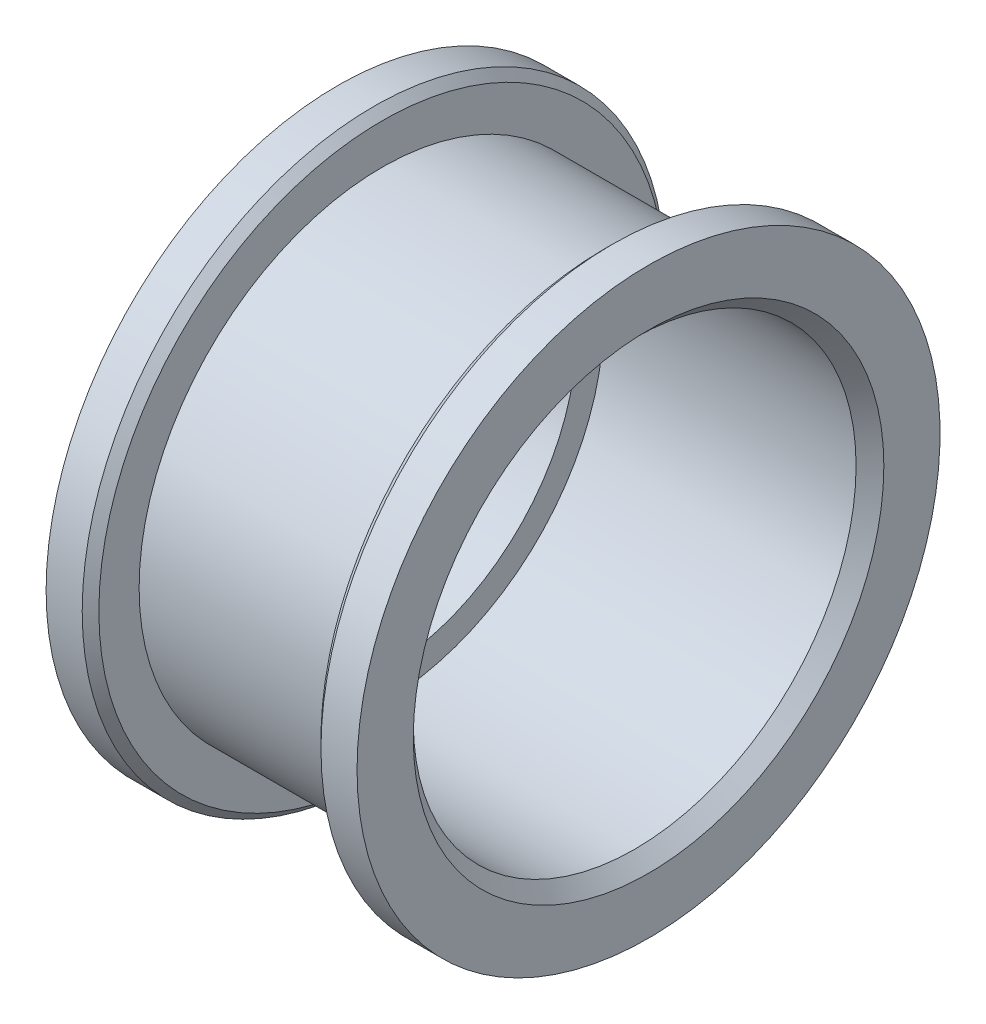
ISO-10303-21;
HEADER;
FILE_DESCRIPTION(('STEP AP214'),'2;1');
FILE_NAME('part.step','',(''),(''),'','','');
FILE_SCHEMA(('AUTOMOTIVE_DESIGN { 1 0 10303 214 1 1 1 1 }'));
ENDSEC;
DATA;
#1=APPLICATION_CONTEXT('core data for automotive mechanical design processes');
#2=APPLICATION_PROTOCOL_DEFINITION('international standard','automotive_design',2000,#1);
#3=PRODUCT_CONTEXT('',#1,'mechanical');
#4=PRODUCT('Part','Part','',(#3));
#5=PRODUCT_RELATED_PRODUCT_CATEGORY('part','',(#4));
#6=PRODUCT_DEFINITION_FORMATION('','',#4);
#7=PRODUCT_DEFINITION_CONTEXT('part definition',#1,'design');
#8=PRODUCT_DEFINITION('design','',#6,#7);
#9=PRODUCT_DEFINITION_SHAPE('','',#8);
#10=(LENGTH_UNIT() NAMED_UNIT(*) SI_UNIT(.MILLI.,.METRE.));
#11=(NAMED_UNIT(*) PLANE_ANGLE_UNIT() SI_UNIT($,.RADIAN.));
#12=(NAMED_UNIT(*) SI_UNIT($,.STERADIAN.) SOLID_ANGLE_UNIT());
#13=UNCERTAINTY_MEASURE_WITH_UNIT(LENGTH_MEASURE(1.E-05),#10,'distance_accuracy_value','');
#14=(GEOMETRIC_REPRESENTATION_CONTEXT(3) GLOBAL_UNCERTAINTY_ASSIGNED_CONTEXT((#13)) GLOBAL_UNIT_ASSIGNED_CONTEXT((#10,
#11,#12)) REPRESENTATION_CONTEXT('',''));
#15=CARTESIAN_POINT('',(0.,0.,0.));
#16=DIRECTION('',(0.,0.,1.));
#17=DIRECTION('',(1.,0.,0.));
#18=AXIS2_PLACEMENT_3D('',#15,#16,#17);
#19=CARTESIAN_POINT('',(6.16,0.,0.));
#20=DIRECTION('',(-1.,0.,0.));
#21=DIRECTION('',(0.,0.,1.));
#22=AXIS2_PLACEMENT_3D('',#19,#20,#21);
#23=CYLINDRICAL_SURFACE('',#22,8.75);
#24=CARTESIAN_POINT('',(4.,0.,0.));
#25=DIRECTION('',(-1.,0.,0.));
#26=DIRECTION('',(0.,0.,1.));
#27=AXIS2_PLACEMENT_3D('',#24,#25,#26);
#28=CIRCLE('',#27,8.75);
#29=CARTESIAN_POINT('',(4.,0.,8.75));
#30=VERTEX_POINT('',#29);
#31=EDGE_CURVE('E52',#30,#30,#28,.F.);
#32=ORIENTED_EDGE('',*,*,#31,.F.);
#33=EDGE_LOOP('',(#32));
#34=FACE_BOUND('',#33,.T.);
#35=CARTESIAN_POINT('',(-4.,0.,0.));
#36=DIRECTION('',(-1.,0.,0.));
#37=DIRECTION('',(0.,0.,1.));
#38=AXIS2_PLACEMENT_3D('',#35,#36,#37);
#39=CIRCLE('',#38,8.75);
#40=CARTESIAN_POINT('',(-4.,0.,8.75));
#41=VERTEX_POINT('',#40);
#42=EDGE_CURVE('E17',#41,#41,#39,.F.);
#43=ORIENTED_EDGE('',*,*,#42,.T.);
#44=EDGE_LOOP('',(#43));
#45=FACE_BOUND('',#44,.T.);
#46=ADVANCED_FACE('F14',(#34,#45),#23,.T.);
#47=CARTESIAN_POINT('',(-4.,0.,0.));
#48=DIRECTION('',(-1.,0.,0.));
#49=DIRECTION('',(0.,0.,1.));
#50=AXIS2_PLACEMENT_3D('',#47,#48,#49);
#51=PLANE('',#50);
#52=ORIENTED_EDGE('',*,*,#42,.F.);
#53=EDGE_LOOP('',(#52));
#54=FACE_BOUND('',#53,.T.);
#55=CARTESIAN_POINT('',(-3.99999999999997,0.,0.));
#56=DIRECTION('',(-1.,0.,0.));
#57=DIRECTION('',(0.,0.,1.));
#58=AXIS2_PLACEMENT_3D('',#55,#56,#57);
#59=CIRCLE('',#58,10.2);
#60=CARTESIAN_POINT('',(-3.99999999999997,0.,10.2));
#61=VERTEX_POINT('',#60);
#62=EDGE_CURVE('E50',#61,#61,#59,.T.);
#63=ORIENTED_EDGE('',*,*,#62,.F.);
#64=EDGE_LOOP('',(#63));
#65=FACE_BOUND('',#64,.T.);
#66=ADVANCED_FACE('F60',(#54,#65),#51,.F.);
#67=CARTESIAN_POINT('',(4.,0.,0.));
#68=DIRECTION('',(-1.,0.,0.));
#69=DIRECTION('',(0.,0.,1.));
#70=AXIS2_PLACEMENT_3D('',#67,#68,#69);
#71=PLANE('',#70);
#72=ORIENTED_EDGE('',*,*,#31,.T.);
#73=EDGE_LOOP('',(#72));
#74=FACE_BOUND('',#73,.T.);
#75=CARTESIAN_POINT('',(4.00000000000198,0.,0.));
#76=DIRECTION('',(1.,0.,0.));
#77=DIRECTION('',(0.,1.,0.));
#78=AXIS2_PLACEMENT_3D('',#75,#76,#77);
#79=CIRCLE('',#78,10.199999999998);
#80=CARTESIAN_POINT('',(4.00000000000198,10.199999999998,0.));
#81=VERTEX_POINT('',#80);
#82=EDGE_CURVE('E47',#81,#81,#79,.T.);
#83=ORIENTED_EDGE('',*,*,#82,.F.);
#84=EDGE_LOOP('',(#83));
#85=FACE_BOUND('',#84,.T.);
#86=ADVANCED_FACE('F63',(#74,#85),#71,.T.);
#87=CARTESIAN_POINT('',(-4.30000000000003,0.,0.));
#88=DIRECTION('',(-1.,0.,0.));
#89=DIRECTION('',(0.,0.,1.));
#90=AXIS2_PLACEMENT_3D('',#87,#88,#89);
#91=CONICAL_SURFACE('',#90,10.5,0.785398163397298);
#92=ORIENTED_EDGE('',*,*,#62,.T.);
#93=EDGE_LOOP('',(#92));
#94=FACE_BOUND('',#93,.T.);
#95=CARTESIAN_POINT('',(-4.3,0.,0.));
#96=DIRECTION('',(-1.,0.,0.));
#97=DIRECTION('',(0.,0.,1.));
#98=AXIS2_PLACEMENT_3D('',#95,#96,#97);
#99=CIRCLE('',#98,10.5);
#100=CARTESIAN_POINT('',(-4.3,0.,10.5));
#101=VERTEX_POINT('',#100);
#102=EDGE_CURVE('E30',#101,#101,#99,.T.);
#103=ORIENTED_EDGE('',*,*,#102,.F.);
#104=EDGE_LOOP('',(#103));
#105=FACE_BOUND('',#104,.T.);
#106=ADVANCED_FACE('F66',(#94,#105),#91,.T.);
#107=CARTESIAN_POINT('',(4.30000000000202,0.,0.));
#108=DIRECTION('',(1.,0.,0.));
#109=DIRECTION('',(0.,1.,0.));
#110=AXIS2_PLACEMENT_3D('',#107,#108,#109);
#111=CONICAL_SURFACE('',#110,10.499999999998,0.785398163397302);
#112=CARTESIAN_POINT('',(4.3,0.,0.));
#113=DIRECTION('',(-1.,0.,0.));
#114=DIRECTION('',(0.,0.,1.));
#115=AXIS2_PLACEMENT_3D('',#112,#113,#114);
#116=CIRCLE('',#115,10.5);
#117=CARTESIAN_POINT('',(4.3,0.,10.5));
#118=VERTEX_POINT('',#117);
#119=EDGE_CURVE('E46',#118,#118,#116,.F.);
#120=ORIENTED_EDGE('',*,*,#119,.F.);
#121=EDGE_LOOP('',(#120));
#122=FACE_BOUND('',#121,.T.);
#123=ORIENTED_EDGE('',*,*,#82,.T.);
#124=EDGE_LOOP('',(#123));
#125=FACE_BOUND('',#124,.T.);
#126=ADVANCED_FACE('F69',(#122,#125),#111,.T.);
#127=CARTESIAN_POINT('',(6.16,0.,0.));
#128=DIRECTION('',(-1.,0.,0.));
#129=DIRECTION('',(0.,0.,1.));
#130=AXIS2_PLACEMENT_3D('',#127,#128,#129);
#131=CYLINDRICAL_SURFACE('',#130,10.5);
#132=CARTESIAN_POINT('',(-5.6,0.,0.));
#133=DIRECTION('',(-1.,0.,0.));
#134=DIRECTION('',(0.,0.,1.));
#135=AXIS2_PLACEMENT_3D('',#132,#133,#134);
#136=CIRCLE('',#135,10.5);
#137=CARTESIAN_POINT('',(-5.6,0.,10.5));
#138=VERTEX_POINT('',#137);
#139=EDGE_CURVE('E43',#138,#138,#136,.T.);
#140=ORIENTED_EDGE('',*,*,#139,.F.);
#141=EDGE_LOOP('',(#140));
#142=FACE_BOUND('',#141,.T.);
#143=ORIENTED_EDGE('',*,*,#102,.T.);
#144=EDGE_LOOP('',(#143));
#145=FACE_BOUND('',#144,.T.);
#146=ADVANCED_FACE('F81',(#142,#145),#131,.T.);
#147=CARTESIAN_POINT('',(6.16,0.,0.));
#148=DIRECTION('',(-1.,0.,0.));
#149=DIRECTION('',(0.,0.,1.));
#150=AXIS2_PLACEMENT_3D('',#147,#148,#149);
#151=CYLINDRICAL_SURFACE('',#150,10.5);
#152=CARTESIAN_POINT('',(5.6,0.,0.));
#153=DIRECTION('',(-1.,0.,0.));
#154=DIRECTION('',(0.,0.,1.));
#155=AXIS2_PLACEMENT_3D('',#152,#153,#154);
#156=CIRCLE('',#155,10.5);
#157=CARTESIAN_POINT('',(5.6,0.,10.5));
#158=VERTEX_POINT('',#157);
#159=EDGE_CURVE('E40',#158,#158,#156,.T.);
#160=ORIENTED_EDGE('',*,*,#159,.T.);
#161=EDGE_LOOP('',(#160));
#162=FACE_BOUND('',#161,.T.);
#163=ORIENTED_EDGE('',*,*,#119,.T.);
#164=EDGE_LOOP('',(#163));
#165=FACE_BOUND('',#164,.T.);
#166=ADVANCED_FACE('F77',(#162,#165),#151,.T.);
#167=CARTESIAN_POINT('',(-5.6,0.,0.));
#168=DIRECTION('',(-1.,0.,0.));
#169=DIRECTION('',(0.,0.,1.));
#170=AXIS2_PLACEMENT_3D('',#167,#168,#169);
#171=PLANE('',#170);
#172=CARTESIAN_POINT('',(-5.6,0.,0.));
#173=DIRECTION('',(-1.,0.,0.));
#174=DIRECTION('',(0.,0.,1.));
#175=AXIS2_PLACEMENT_3D('',#172,#173,#174);
#176=CIRCLE('',#175,7.);
#177=CARTESIAN_POINT('',(-5.6,0.,7.));
#178=VERTEX_POINT('',#177);
#179=EDGE_CURVE('E37',#178,#178,#176,.F.);
#180=ORIENTED_EDGE('',*,*,#179,.T.);
#181=EDGE_LOOP('',(#180));
#182=FACE_BOUND('',#181,.T.);
#183=ORIENTED_EDGE('',*,*,#139,.T.);
#184=EDGE_LOOP('',(#183));
#185=FACE_BOUND('',#184,.T.);
#186=ADVANCED_FACE('F113',(#182,#185),#171,.T.);
#187=CARTESIAN_POINT('',(5.6,0.,0.));
#188=DIRECTION('',(-1.,0.,0.));
#189=DIRECTION('',(0.,0.,1.));
#190=AXIS2_PLACEMENT_3D('',#187,#188,#189);
#191=PLANE('',#190);
#192=CARTESIAN_POINT('',(5.60000000000004,0.,0.));
#193=DIRECTION('',(1.,0.,0.));
#194=DIRECTION('',(0.,0.,-1.));
#195=AXIS2_PLACEMENT_3D('',#192,#193,#194);
#196=CIRCLE('',#195,8.47499999999996);
#197=CARTESIAN_POINT('',(5.60000000000004,0.,-8.47499999999996));
#198=VERTEX_POINT('',#197);
#199=EDGE_CURVE('E34',#198,#198,#196,.F.);
#200=ORIENTED_EDGE('',*,*,#199,.T.);
#201=EDGE_LOOP('',(#200));
#202=FACE_BOUND('',#201,.T.);
#203=ORIENTED_EDGE('',*,*,#159,.F.);
#204=EDGE_LOOP('',(#203));
#205=FACE_BOUND('',#204,.T.);
#206=ADVANCED_FACE('F109',(#202,#205),#191,.F.);
#207=CARTESIAN_POINT('',(6.16,0.,0.));
#208=DIRECTION('',(-1.,0.,0.));
#209=DIRECTION('',(0.,0.,1.));
#210=AXIS2_PLACEMENT_3D('',#207,#208,#209);
#211=CYLINDRICAL_SURFACE('',#210,7.);
#212=CARTESIAN_POINT('',(-4.,0.,0.));
#213=DIRECTION('',(-1.,0.,0.));
#214=DIRECTION('',(0.,0.,1.));
#215=AXIS2_PLACEMENT_3D('',#212,#213,#214);
#216=CIRCLE('',#215,7.);
#217=CARTESIAN_POINT('',(-4.,0.,7.));
#218=VERTEX_POINT('',#217);
#219=EDGE_CURVE('E26',#218,#218,#216,.F.);
#220=ORIENTED_EDGE('',*,*,#219,.T.);
#221=EDGE_LOOP('',(#220));
#222=FACE_BOUND('',#221,.T.);
#223=ORIENTED_EDGE('',*,*,#179,.F.);
#224=EDGE_LOOP('',(#223));
#225=FACE_BOUND('',#224,.T.);
#226=ADVANCED_FACE('F105',(#222,#225),#211,.F.);
#227=CARTESIAN_POINT('',(5.60000000000004,0.,0.));
#228=DIRECTION('',(1.,0.,0.));
#229=DIRECTION('',(0.,0.,-1.));
#230=AXIS2_PLACEMENT_3D('',#227,#228,#229);
#231=CONICAL_SURFACE('',#230,8.47499999999996,0.785398163397299);
#232=CARTESIAN_POINT('',(5.1,0.,0.));
#233=DIRECTION('',(-1.,0.,0.));
#234=DIRECTION('',(0.,0.,1.));
#235=AXIS2_PLACEMENT_3D('',#232,#233,#234);
#236=CIRCLE('',#235,7.975);
#237=CARTESIAN_POINT('',(5.1,0.,7.975));
#238=VERTEX_POINT('',#237);
#239=EDGE_CURVE('E21',#238,#238,#236,.T.);
#240=ORIENTED_EDGE('',*,*,#239,.T.);
#241=EDGE_LOOP('',(#240));
#242=FACE_BOUND('',#241,.T.);
#243=ORIENTED_EDGE('',*,*,#199,.F.);
#244=EDGE_LOOP('',(#243));
#245=FACE_BOUND('',#244,.T.);
#246=ADVANCED_FACE('F98',(#242,#245),#231,.F.);
#247=CARTESIAN_POINT('',(-4.,0.,0.));
#248=DIRECTION('',(-1.,0.,0.));
#249=DIRECTION('',(0.,0.,1.));
#250=AXIS2_PLACEMENT_3D('',#247,#248,#249);
#251=PLANE('',#250);
#252=ORIENTED_EDGE('',*,*,#219,.F.);
#253=EDGE_LOOP('',(#252));
#254=FACE_BOUND('',#253,.T.);
#255=CARTESIAN_POINT('',(-4.,0.,0.));
#256=DIRECTION('',(-1.,0.,0.));
#257=DIRECTION('',(0.,0.,1.));
#258=AXIS2_PLACEMENT_3D('',#255,#256,#257);
#259=CIRCLE('',#258,7.975);
#260=CARTESIAN_POINT('',(-4.,0.,7.975));
#261=VERTEX_POINT('',#260);
#262=EDGE_CURVE('E10',#261,#261,#259,.F.);
#263=ORIENTED_EDGE('',*,*,#262,.T.);
#264=EDGE_LOOP('',(#263));
#265=FACE_BOUND('',#264,.T.);
#266=ADVANCED_FACE('F92',(#254,#265),#251,.F.);
#267=CARTESIAN_POINT('',(6.16,0.,0.));
#268=DIRECTION('',(-1.,0.,0.));
#269=DIRECTION('',(0.,0.,1.));
#270=AXIS2_PLACEMENT_3D('',#267,#268,#269);
#271=CYLINDRICAL_SURFACE('',#270,7.975);
#272=ORIENTED_EDGE('',*,*,#262,.F.);
#273=EDGE_LOOP('',(#272));
#274=FACE_BOUND('',#273,.T.);
#275=ORIENTED_EDGE('',*,*,#239,.F.);
#276=EDGE_LOOP('',(#275));
#277=FACE_BOUND('',#276,.T.);
#278=ADVANCED_FACE('F90',(#274,#277),#271,.F.);
#279=CLOSED_SHELL('',(#46,#66,#86,#106,#126,#146,#166,#186,#206,#226,#246,#266,#278));
#280=MANIFOLD_SOLID_BREP('B1',#279);
#281=ADVANCED_BREP_SHAPE_REPRESENTATION('',(#18,#280),#14);
#282=SHAPE_DEFINITION_REPRESENTATION(#9,#281);
ENDSEC;
END-ISO-10303-21;
